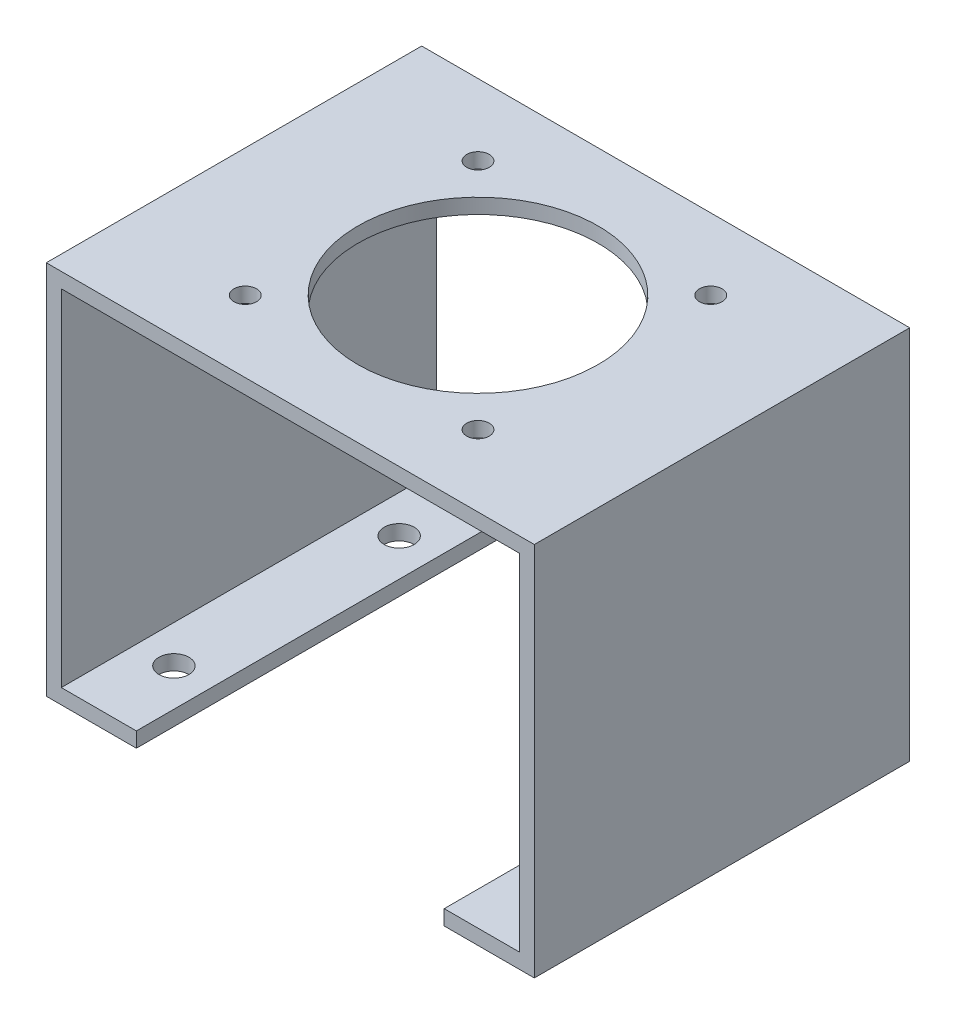
ISO-10303-21;
HEADER;
FILE_DESCRIPTION(('STEP AP214'),'2;1');
FILE_NAME('part.step','',(''),(''),'','','');
FILE_SCHEMA(('AUTOMOTIVE_DESIGN { 1 0 10303 214 1 1 1 1 }'));
ENDSEC;
DATA;
#1=APPLICATION_CONTEXT('core data for automotive mechanical design processes');
#2=APPLICATION_PROTOCOL_DEFINITION('international standard','automotive_design',2000,#1);
#3=PRODUCT_CONTEXT('',#1,'mechanical');
#4=PRODUCT('Part','Part','',(#3));
#5=PRODUCT_RELATED_PRODUCT_CATEGORY('part','',(#4));
#6=PRODUCT_DEFINITION_FORMATION('','',#4);
#7=PRODUCT_DEFINITION_CONTEXT('part definition',#1,'design');
#8=PRODUCT_DEFINITION('design','',#6,#7);
#9=PRODUCT_DEFINITION_SHAPE('','',#8);
#10=(LENGTH_UNIT() NAMED_UNIT(*) SI_UNIT(.MILLI.,.METRE.));
#11=(NAMED_UNIT(*) PLANE_ANGLE_UNIT() SI_UNIT($,.RADIAN.));
#12=(NAMED_UNIT(*) SI_UNIT($,.STERADIAN.) SOLID_ANGLE_UNIT());
#13=UNCERTAINTY_MEASURE_WITH_UNIT(LENGTH_MEASURE(1.E-05),#10,'distance_accuracy_value','');
#14=(GEOMETRIC_REPRESENTATION_CONTEXT(3) GLOBAL_UNCERTAINTY_ASSIGNED_CONTEXT((#13)) GLOBAL_UNIT_ASSIGNED_CONTEXT((#10,
#11,#12)) REPRESENTATION_CONTEXT('',''));
#15=CARTESIAN_POINT('',(0.,0.,0.));
#16=DIRECTION('',(0.,0.,1.));
#17=DIRECTION('',(1.,0.,0.));
#18=AXIS2_PLACEMENT_3D('',#15,#16,#17);
#19=CARTESIAN_POINT('',(0.,-2.,0.));
#20=DIRECTION('',(0.,1.,0.));
#21=DIRECTION('',(0.,0.,1.));
#22=AXIS2_PLACEMENT_3D('',#19,#20,#21);
#23=PLANE('',#22);
#24=CARTESIAN_POINT('',(0.,-2.,1.11022302462516E-13));
#25=DIRECTION('',(0.,1.,0.));
#26=DIRECTION('',(0.,0.,1.));
#27=AXIS2_PLACEMENT_3D('',#24,#25,#26);
#28=CIRCLE('',#27,16.);
#29=CARTESIAN_POINT('',(0.,-2.,16.0000000000001));
#30=VERTEX_POINT('',#29);
#31=EDGE_CURVE('E497',#30,#30,#28,.T.);
#32=ORIENTED_EDGE('',*,*,#31,.T.);
#33=EDGE_LOOP('',(#32));
#34=FACE_BOUND('',#33,.T.);
#35=CARTESIAN_POINT('',(15.5,-2.,-15.4999999999999));
#36=DIRECTION('',(0.,1.,0.));
#37=DIRECTION('',(0.,0.,1.));
#38=AXIS2_PLACEMENT_3D('',#35,#36,#37);
#39=CIRCLE('',#38,1.5);
#40=CARTESIAN_POINT('',(15.5,-2.,-13.9999999999999));
#41=VERTEX_POINT('',#40);
#42=EDGE_CURVE('E159',#41,#41,#39,.T.);
#43=ORIENTED_EDGE('',*,*,#42,.T.);
#44=EDGE_LOOP('',(#43));
#45=FACE_BOUND('',#44,.T.);
#46=CARTESIAN_POINT('',(15.5,-2.,15.5000000000001));
#47=DIRECTION('',(0.,1.,0.));
#48=DIRECTION('',(0.,0.,1.));
#49=AXIS2_PLACEMENT_3D('',#46,#47,#48);
#50=CIRCLE('',#49,1.5);
#51=CARTESIAN_POINT('',(15.5,-2.,17.0000000000001));
#52=VERTEX_POINT('',#51);
#53=EDGE_CURVE('E517',#52,#52,#50,.T.);
#54=ORIENTED_EDGE('',*,*,#53,.T.);
#55=EDGE_LOOP('',(#54));
#56=FACE_BOUND('',#55,.T.);
#57=CARTESIAN_POINT('',(-15.5,-2.,15.5000000000001));
#58=DIRECTION('',(0.,1.,0.));
#59=DIRECTION('',(0.,0.,1.));
#60=AXIS2_PLACEMENT_3D('',#57,#58,#59);
#61=CIRCLE('',#60,1.5);
#62=CARTESIAN_POINT('',(-15.5,-2.,17.0000000000001));
#63=VERTEX_POINT('',#62);
#64=EDGE_CURVE('E514',#63,#63,#61,.T.);
#65=ORIENTED_EDGE('',*,*,#64,.T.);
#66=EDGE_LOOP('',(#65));
#67=FACE_BOUND('',#66,.T.);
#68=CARTESIAN_POINT('',(-15.5,-2.,-15.4999999999999));
#69=DIRECTION('',(0.,1.,0.));
#70=DIRECTION('',(0.,0.,1.));
#71=AXIS2_PLACEMENT_3D('',#68,#69,#70);
#72=CIRCLE('',#71,1.5);
#73=CARTESIAN_POINT('',(-15.5,-2.,-13.9999999999999));
#74=VERTEX_POINT('',#73);
#75=EDGE_CURVE('E511',#74,#74,#72,.T.);
#76=ORIENTED_EDGE('',*,*,#75,.T.);
#77=EDGE_LOOP('',(#76));
#78=FACE_BOUND('',#77,.T.);
#79=DIRECTION('',(0.,0.,-1.));
#80=VECTOR('',#79,1.);
#81=CARTESIAN_POINT('',(30.5,-2.,0.));
#82=LINE('',#81,#80);
#83=CARTESIAN_POINT('',(30.5,-2.,25.));
#84=VERTEX_POINT('',#83);
#85=CARTESIAN_POINT('',(30.5,-2.,-25.));
#86=VERTEX_POINT('',#85);
#87=EDGE_CURVE('E169',#84,#86,#82,.T.);
#88=ORIENTED_EDGE('',*,*,#87,.F.);
#89=DIRECTION('',(1.,0.,0.));
#90=VECTOR('',#89,1.);
#91=CARTESIAN_POINT('',(32.5,-2.,25.));
#92=LINE('',#91,#90);
#93=CARTESIAN_POINT('',(-30.5,-2.,25.));
#94=VERTEX_POINT('',#93);
#95=EDGE_CURVE('E207',#94,#84,#92,.T.);
#96=ORIENTED_EDGE('',*,*,#95,.F.);
#97=DIRECTION('',(0.,0.,1.));
#98=VECTOR('',#97,1.);
#99=CARTESIAN_POINT('',(-30.5,-2.,0.));
#100=LINE('',#99,#98);
#101=CARTESIAN_POINT('',(-30.5,-2.,-25.));
#102=VERTEX_POINT('',#101);
#103=EDGE_CURVE('E201',#102,#94,#100,.T.);
#104=ORIENTED_EDGE('',*,*,#103,.F.);
#105=DIRECTION('',(-1.,0.,0.));
#106=VECTOR('',#105,1.);
#107=CARTESIAN_POINT('',(32.5,-2.,-25.));
#108=LINE('',#107,#106);
#109=EDGE_CURVE('E209',#86,#102,#108,.T.);
#110=ORIENTED_EDGE('',*,*,#109,.F.);
#111=EDGE_LOOP('',(#88,#96,#104,#110));
#112=FACE_BOUND('',#111,.T.);
#113=ADVANCED_FACE('F38',(#34,#45,#56,#67,#78,#112),#23,.F.);
#114=CARTESIAN_POINT('',(-30.5,0.,0.));
#115=DIRECTION('',(-1.,0.,0.));
#116=DIRECTION('',(0.,0.,1.));
#117=AXIS2_PLACEMENT_3D('',#114,#115,#116);
#118=PLANE('',#117);
#119=DIRECTION('',(0.,0.,1.));
#120=VECTOR('',#119,1.);
#121=CARTESIAN_POINT('',(-30.5,-48.,25.));
#122=LINE('',#121,#120);
#123=CARTESIAN_POINT('',(-30.5,-48.,-25.));
#124=VERTEX_POINT('',#123);
#125=CARTESIAN_POINT('',(-30.5,-48.,25.));
#126=VERTEX_POINT('',#125);
#127=EDGE_CURVE('E172',#124,#126,#122,.T.);
#128=ORIENTED_EDGE('',*,*,#127,.F.);
#129=DIRECTION('',(0.,-1.,0.));
#130=VECTOR('',#129,1.);
#131=CARTESIAN_POINT('',(-30.5,0.,-25.));
#132=LINE('',#131,#130);
#133=EDGE_CURVE('E190',#102,#124,#132,.T.);
#134=ORIENTED_EDGE('',*,*,#133,.F.);
#135=ORIENTED_EDGE('',*,*,#103,.T.);
#136=DIRECTION('',(0.,1.,0.));
#137=VECTOR('',#136,1.);
#138=CARTESIAN_POINT('',(-30.5,0.,25.));
#139=LINE('',#138,#137);
#140=EDGE_CURVE('E193',#126,#94,#139,.T.);
#141=ORIENTED_EDGE('',*,*,#140,.F.);
#142=EDGE_LOOP('',(#128,#134,#135,#141));
#143=FACE_BOUND('',#142,.T.);
#144=ADVANCED_FACE('F247',(#143),#118,.F.);
#145=CARTESIAN_POINT('',(-32.5,-2.,25.));
#146=DIRECTION('',(-1.,0.,0.));
#147=DIRECTION('',(0.,0.,1.));
#148=AXIS2_PLACEMENT_3D('',#145,#146,#147);
#149=PLANE('',#148);
#150=DIRECTION('',(0.,0.,1.));
#151=VECTOR('',#150,1.);
#152=CARTESIAN_POINT('',(-32.5,0.,25.));
#153=LINE('',#152,#151);
#154=CARTESIAN_POINT('',(-32.5,0.,-25.));
#155=VERTEX_POINT('',#154);
#156=CARTESIAN_POINT('',(-32.5,0.,25.));
#157=VERTEX_POINT('',#156);
#158=EDGE_CURVE('E206',#155,#157,#153,.T.);
#159=ORIENTED_EDGE('',*,*,#158,.F.);
#160=DIRECTION('',(0.,1.,0.));
#161=VECTOR('',#160,1.);
#162=CARTESIAN_POINT('',(-32.5,-2.,-25.));
#163=LINE('',#162,#161);
#164=CARTESIAN_POINT('',(-32.5,-50.,-25.));
#165=VERTEX_POINT('',#164);
#166=EDGE_CURVE('E11',#165,#155,#163,.T.);
#167=ORIENTED_EDGE('',*,*,#166,.F.);
#168=DIRECTION('',(0.,0.,1.));
#169=VECTOR('',#168,1.);
#170=CARTESIAN_POINT('',(-32.5,-50.,-25.));
#171=LINE('',#170,#169);
#172=CARTESIAN_POINT('',(-32.5,-50.,25.));
#173=VERTEX_POINT('',#172);
#174=EDGE_CURVE('E189',#165,#173,#171,.T.);
#175=ORIENTED_EDGE('',*,*,#174,.T.);
#176=DIRECTION('',(0.,1.,0.));
#177=VECTOR('',#176,1.);
#178=CARTESIAN_POINT('',(-32.5,-2.,25.));
#179=LINE('',#178,#177);
#180=EDGE_CURVE('E42',#173,#157,#179,.T.);
#181=ORIENTED_EDGE('',*,*,#180,.T.);
#182=EDGE_LOOP('',(#159,#167,#175,#181));
#183=FACE_BOUND('',#182,.T.);
#184=ADVANCED_FACE('F40',(#183),#149,.T.);
#185=CARTESIAN_POINT('',(32.5,-2.,-25.));
#186=DIRECTION('',(0.,0.,-1.));
#187=DIRECTION('',(-1.,0.,0.));
#188=AXIS2_PLACEMENT_3D('',#185,#186,#187);
#189=PLANE('',#188);
#190=DIRECTION('',(0.,1.,0.));
#191=VECTOR('',#190,1.);
#192=CARTESIAN_POINT('',(32.5,-2.,-25.));
#193=LINE('',#192,#191);
#194=CARTESIAN_POINT('',(32.5,-50.,-25.));
#195=VERTEX_POINT('',#194);
#196=CARTESIAN_POINT('',(32.5,0.,-25.));
#197=VERTEX_POINT('',#196);
#198=EDGE_CURVE('E47',#195,#197,#193,.T.);
#199=ORIENTED_EDGE('',*,*,#198,.F.);
#200=DIRECTION('',(1.,0.,0.));
#201=VECTOR('',#200,1.);
#202=CARTESIAN_POINT('',(30.5,-50.,-25.));
#203=LINE('',#202,#201);
#204=CARTESIAN_POINT('',(20.5,-50.,-25.));
#205=VERTEX_POINT('',#204);
#206=EDGE_CURVE('E166',#205,#195,#203,.T.);
#207=ORIENTED_EDGE('',*,*,#206,.F.);
#208=DIRECTION('',(0.,1.,0.));
#209=VECTOR('',#208,1.);
#210=CARTESIAN_POINT('',(20.5,-50.,-25.));
#211=LINE('',#210,#209);
#212=CARTESIAN_POINT('',(20.5,-48.,-25.));
#213=VERTEX_POINT('',#212);
#214=EDGE_CURVE('E152',#205,#213,#211,.T.);
#215=ORIENTED_EDGE('',*,*,#214,.T.);
#216=DIRECTION('',(1.,0.,0.));
#217=VECTOR('',#216,1.);
#218=CARTESIAN_POINT('',(20.5,-48.,-25.));
#219=LINE('',#218,#217);
#220=CARTESIAN_POINT('',(30.5,-48.,-25.));
#221=VERTEX_POINT('',#220);
#222=EDGE_CURVE('E140',#213,#221,#219,.T.);
#223=ORIENTED_EDGE('',*,*,#222,.T.);
#224=DIRECTION('',(0.,-1.,0.));
#225=VECTOR('',#224,1.);
#226=CARTESIAN_POINT('',(30.5,0.,-25.));
#227=LINE('',#226,#225);
#228=EDGE_CURVE('E55',#86,#221,#227,.T.);
#229=ORIENTED_EDGE('',*,*,#228,.F.);
#230=ORIENTED_EDGE('',*,*,#109,.T.);
#231=ORIENTED_EDGE('',*,*,#133,.T.);
#232=DIRECTION('',(-1.,0.,0.));
#233=VECTOR('',#232,1.);
#234=CARTESIAN_POINT('',(-20.5,-48.,-25.));
#235=LINE('',#234,#233);
#236=CARTESIAN_POINT('',(-20.5,-48.,-25.));
#237=VERTEX_POINT('',#236);
#238=EDGE_CURVE('E187',#237,#124,#235,.T.);
#239=ORIENTED_EDGE('',*,*,#238,.F.);
#240=DIRECTION('',(0.,1.,0.));
#241=VECTOR('',#240,1.);
#242=CARTESIAN_POINT('',(-20.5,-50.,-25.));
#243=LINE('',#242,#241);
#244=CARTESIAN_POINT('',(-20.5,-50.,-25.));
#245=VERTEX_POINT('',#244);
#246=EDGE_CURVE('E179',#245,#237,#243,.T.);
#247=ORIENTED_EDGE('',*,*,#246,.F.);
#248=DIRECTION('',(-1.,0.,0.));
#249=VECTOR('',#248,1.);
#250=CARTESIAN_POINT('',(-30.5,-50.,-25.));
#251=LINE('',#250,#249);
#252=EDGE_CURVE('E195',#245,#165,#251,.T.);
#253=ORIENTED_EDGE('',*,*,#252,.T.);
#254=ORIENTED_EDGE('',*,*,#166,.T.);
#255=DIRECTION('',(-1.,0.,0.));
#256=VECTOR('',#255,1.);
#257=CARTESIAN_POINT('',(32.5,0.,-25.));
#258=LINE('',#257,#256);
#259=EDGE_CURVE('E210',#197,#155,#258,.T.);
#260=ORIENTED_EDGE('',*,*,#259,.F.);
#261=EDGE_LOOP('',(#199,#207,#215,#223,#229,#230,#231,#239,#247,#253,#254,#260));
#262=FACE_BOUND('',#261,.T.);
#263=ADVANCED_FACE('F230',(#262),#189,.T.);
#264=CARTESIAN_POINT('',(32.5,-2.,25.));
#265=DIRECTION('',(1.,0.,0.));
#266=DIRECTION('',(0.,0.,-1.));
#267=AXIS2_PLACEMENT_3D('',#264,#265,#266);
#268=PLANE('',#267);
#269=DIRECTION('',(0.,0.,-1.));
#270=VECTOR('',#269,1.);
#271=CARTESIAN_POINT('',(32.5,0.,25.));
#272=LINE('',#271,#270);
#273=CARTESIAN_POINT('',(32.5,0.,25.));
#274=VERTEX_POINT('',#273);
#275=EDGE_CURVE('E216',#274,#197,#272,.T.);
#276=ORIENTED_EDGE('',*,*,#275,.F.);
#277=DIRECTION('',(0.,1.,0.));
#278=VECTOR('',#277,1.);
#279=CARTESIAN_POINT('',(32.5,-2.,25.));
#280=LINE('',#279,#278);
#281=CARTESIAN_POINT('',(32.5,-50.,25.));
#282=VERTEX_POINT('',#281);
#283=EDGE_CURVE('E220',#282,#274,#280,.T.);
#284=ORIENTED_EDGE('',*,*,#283,.F.);
#285=DIRECTION('',(0.,0.,1.));
#286=VECTOR('',#285,1.);
#287=CARTESIAN_POINT('',(32.5,-50.,-25.));
#288=LINE('',#287,#286);
#289=EDGE_CURVE('E139',#195,#282,#288,.T.);
#290=ORIENTED_EDGE('',*,*,#289,.F.);
#291=ORIENTED_EDGE('',*,*,#198,.T.);
#292=EDGE_LOOP('',(#276,#284,#290,#291));
#293=FACE_BOUND('',#292,.T.);
#294=ADVANCED_FACE('F281',(#293),#268,.T.);
#295=CARTESIAN_POINT('',(32.5,-2.,25.));
#296=DIRECTION('',(0.,0.,1.));
#297=DIRECTION('',(1.,0.,0.));
#298=AXIS2_PLACEMENT_3D('',#295,#296,#297);
#299=PLANE('',#298);
#300=ORIENTED_EDGE('',*,*,#283,.T.);
#301=DIRECTION('',(1.,0.,0.));
#302=VECTOR('',#301,1.);
#303=CARTESIAN_POINT('',(32.5,0.,25.));
#304=LINE('',#303,#302);
#305=EDGE_CURVE('E214',#157,#274,#304,.T.);
#306=ORIENTED_EDGE('',*,*,#305,.F.);
#307=ORIENTED_EDGE('',*,*,#180,.F.);
#308=DIRECTION('',(-1.,0.,0.));
#309=VECTOR('',#308,1.);
#310=CARTESIAN_POINT('',(-30.5,-50.,25.));
#311=LINE('',#310,#309);
#312=CARTESIAN_POINT('',(-20.5,-50.,25.));
#313=VERTEX_POINT('',#312);
#314=EDGE_CURVE('E198',#313,#173,#311,.T.);
#315=ORIENTED_EDGE('',*,*,#314,.F.);
#316=DIRECTION('',(0.,-1.,0.));
#317=VECTOR('',#316,1.);
#318=CARTESIAN_POINT('',(-20.5,-50.,25.));
#319=LINE('',#318,#317);
#320=CARTESIAN_POINT('',(-20.5,-48.,25.));
#321=VERTEX_POINT('',#320);
#322=EDGE_CURVE('E173',#321,#313,#319,.T.);
#323=ORIENTED_EDGE('',*,*,#322,.F.);
#324=DIRECTION('',(-1.,0.,0.));
#325=VECTOR('',#324,1.);
#326=CARTESIAN_POINT('',(-20.5,-48.,25.));
#327=LINE('',#326,#325);
#328=EDGE_CURVE('E183',#321,#126,#327,.T.);
#329=ORIENTED_EDGE('',*,*,#328,.T.);
#330=ORIENTED_EDGE('',*,*,#140,.T.);
#331=ORIENTED_EDGE('',*,*,#95,.T.);
#332=DIRECTION('',(0.,1.,0.));
#333=VECTOR('',#332,1.);
#334=CARTESIAN_POINT('',(30.5,0.,25.));
#335=LINE('',#334,#333);
#336=CARTESIAN_POINT('',(30.5,-48.,25.));
#337=VERTEX_POINT('',#336);
#338=EDGE_CURVE('E136',#337,#84,#335,.T.);
#339=ORIENTED_EDGE('',*,*,#338,.F.);
#340=DIRECTION('',(1.,0.,0.));
#341=VECTOR('',#340,1.);
#342=CARTESIAN_POINT('',(20.5,-48.,25.));
#343=LINE('',#342,#341);
#344=CARTESIAN_POINT('',(20.5,-48.,25.));
#345=VERTEX_POINT('',#344);
#346=EDGE_CURVE('E128',#345,#337,#343,.T.);
#347=ORIENTED_EDGE('',*,*,#346,.F.);
#348=DIRECTION('',(0.,-1.,0.));
#349=VECTOR('',#348,1.);
#350=CARTESIAN_POINT('',(20.5,-50.,25.));
#351=LINE('',#350,#349);
#352=CARTESIAN_POINT('',(20.5,-50.,25.));
#353=VERTEX_POINT('',#352);
#354=EDGE_CURVE('E133',#345,#353,#351,.T.);
#355=ORIENTED_EDGE('',*,*,#354,.T.);
#356=DIRECTION('',(1.,0.,0.));
#357=VECTOR('',#356,1.);
#358=CARTESIAN_POINT('',(30.5,-50.,25.));
#359=LINE('',#358,#357);
#360=EDGE_CURVE('E163',#353,#282,#359,.T.);
#361=ORIENTED_EDGE('',*,*,#360,.T.);
#362=EDGE_LOOP('',(#300,#306,#307,#315,#323,#329,#330,#331,#339,#347,#355,#361));
#363=FACE_BOUND('',#362,.T.);
#364=ADVANCED_FACE('F131',(#363),#299,.T.);
#365=CARTESIAN_POINT('',(0.,0.,0.));
#366=DIRECTION('',(0.,1.,0.));
#367=DIRECTION('',(0.,0.,1.));
#368=AXIS2_PLACEMENT_3D('',#365,#366,#367);
#369=PLANE('',#368);
#370=CARTESIAN_POINT('',(0.,0.,1.11022302462516E-13));
#371=DIRECTION('',(0.,1.,0.));
#372=DIRECTION('',(0.,0.,1.));
#373=AXIS2_PLACEMENT_3D('',#370,#371,#372);
#374=CIRCLE('',#373,16.);
#375=CARTESIAN_POINT('',(0.,0.,16.0000000000001));
#376=VERTEX_POINT('',#375);
#377=EDGE_CURVE('E494',#376,#376,#374,.T.);
#378=ORIENTED_EDGE('',*,*,#377,.F.);
#379=EDGE_LOOP('',(#378));
#380=FACE_BOUND('',#379,.T.);
#381=CARTESIAN_POINT('',(15.5,0.,-15.4999999999999));
#382=DIRECTION('',(0.,1.,0.));
#383=DIRECTION('',(0.,0.,1.));
#384=AXIS2_PLACEMENT_3D('',#381,#382,#383);
#385=CIRCLE('',#384,1.5);
#386=CARTESIAN_POINT('',(15.5,0.,-13.9999999999999));
#387=VERTEX_POINT('',#386);
#388=EDGE_CURVE('E499',#387,#387,#385,.T.);
#389=ORIENTED_EDGE('',*,*,#388,.F.);
#390=EDGE_LOOP('',(#389));
#391=FACE_BOUND('',#390,.T.);
#392=CARTESIAN_POINT('',(15.5,0.,15.5000000000001));
#393=DIRECTION('',(0.,1.,0.));
#394=DIRECTION('',(0.,0.,1.));
#395=AXIS2_PLACEMENT_3D('',#392,#393,#394);
#396=CIRCLE('',#395,1.5);
#397=CARTESIAN_POINT('',(15.5,0.,17.0000000000001));
#398=VERTEX_POINT('',#397);
#399=EDGE_CURVE('E504',#398,#398,#396,.T.);
#400=ORIENTED_EDGE('',*,*,#399,.F.);
#401=EDGE_LOOP('',(#400));
#402=FACE_BOUND('',#401,.T.);
#403=CARTESIAN_POINT('',(-15.5,0.,15.5000000000001));
#404=DIRECTION('',(0.,1.,0.));
#405=DIRECTION('',(0.,0.,1.));
#406=AXIS2_PLACEMENT_3D('',#403,#404,#405);
#407=CIRCLE('',#406,1.5);
#408=CARTESIAN_POINT('',(-15.5,0.,17.0000000000001));
#409=VERTEX_POINT('',#408);
#410=EDGE_CURVE('E500',#409,#409,#407,.T.);
#411=ORIENTED_EDGE('',*,*,#410,.F.);
#412=EDGE_LOOP('',(#411));
#413=FACE_BOUND('',#412,.T.);
#414=CARTESIAN_POINT('',(-15.5,0.,-15.4999999999999));
#415=DIRECTION('',(0.,1.,0.));
#416=DIRECTION('',(0.,0.,1.));
#417=AXIS2_PLACEMENT_3D('',#414,#415,#416);
#418=CIRCLE('',#417,1.5);
#419=CARTESIAN_POINT('',(-15.5,0.,-13.9999999999999));
#420=VERTEX_POINT('',#419);
#421=EDGE_CURVE('E503',#420,#420,#418,.T.);
#422=ORIENTED_EDGE('',*,*,#421,.F.);
#423=EDGE_LOOP('',(#422));
#424=FACE_BOUND('',#423,.T.);
#425=ORIENTED_EDGE('',*,*,#259,.T.);
#426=ORIENTED_EDGE('',*,*,#158,.T.);
#427=ORIENTED_EDGE('',*,*,#305,.T.);
#428=ORIENTED_EDGE('',*,*,#275,.T.);
#429=EDGE_LOOP('',(#425,#426,#427,#428));
#430=FACE_BOUND('',#429,.T.);
#431=ADVANCED_FACE('F227',(#380,#391,#402,#413,#424,#430),#369,.T.);
#432=CARTESIAN_POINT('',(-30.5,-50.,-25.));
#433=DIRECTION('',(0.,-1.,0.));
#434=DIRECTION('',(0.,0.,-1.));
#435=AXIS2_PLACEMENT_3D('',#432,#433,#434);
#436=PLANE('',#435);
#437=CARTESIAN_POINT('',(-25.5,-50.,-15.));
#438=DIRECTION('',(0.,-1.,0.));
#439=DIRECTION('',(0.,0.,-1.));
#440=AXIS2_PLACEMENT_3D('',#437,#438,#439);
#441=CIRCLE('',#440,2.);
#442=CARTESIAN_POINT('',(-25.5,-50.,-17.));
#443=VERTEX_POINT('',#442);
#444=EDGE_CURVE('E470',#443,#443,#441,.T.);
#445=ORIENTED_EDGE('',*,*,#444,.F.);
#446=EDGE_LOOP('',(#445));
#447=FACE_BOUND('',#446,.T.);
#448=CARTESIAN_POINT('',(-25.5,-50.,15.));
#449=DIRECTION('',(0.,-1.,0.));
#450=DIRECTION('',(0.,0.,-1.));
#451=AXIS2_PLACEMENT_3D('',#448,#449,#450);
#452=CIRCLE('',#451,2.);
#453=CARTESIAN_POINT('',(-25.5,-50.,13.));
#454=VERTEX_POINT('',#453);
#455=EDGE_CURVE('E490',#454,#454,#452,.T.);
#456=ORIENTED_EDGE('',*,*,#455,.F.);
#457=EDGE_LOOP('',(#456));
#458=FACE_BOUND('',#457,.T.);
#459=ORIENTED_EDGE('',*,*,#174,.F.);
#460=ORIENTED_EDGE('',*,*,#252,.F.);
#461=DIRECTION('',(0.,0.,-1.));
#462=VECTOR('',#461,1.);
#463=CARTESIAN_POINT('',(-20.5,-50.,25.));
#464=LINE('',#463,#462);
#465=EDGE_CURVE('E176',#313,#245,#464,.T.);
#466=ORIENTED_EDGE('',*,*,#465,.F.);
#467=ORIENTED_EDGE('',*,*,#314,.T.);
#468=EDGE_LOOP('',(#459,#460,#466,#467));
#469=FACE_BOUND('',#468,.T.);
#470=ADVANCED_FACE('F235',(#447,#458,#469),#436,.T.);
#471=CARTESIAN_POINT('',(-20.5,-48.,25.));
#472=DIRECTION('',(0.,-1.,0.));
#473=DIRECTION('',(0.,0.,-1.));
#474=AXIS2_PLACEMENT_3D('',#471,#472,#473);
#475=PLANE('',#474);
#476=CARTESIAN_POINT('',(-25.5,-48.,-15.));
#477=DIRECTION('',(0.,1.,0.));
#478=DIRECTION('',(0.,0.,-1.));
#479=AXIS2_PLACEMENT_3D('',#476,#477,#478);
#480=CIRCLE('',#479,2.);
#481=CARTESIAN_POINT('',(-25.5,-48.,-17.));
#482=VERTEX_POINT('',#481);
#483=EDGE_CURVE('E473',#482,#482,#480,.T.);
#484=ORIENTED_EDGE('',*,*,#483,.F.);
#485=EDGE_LOOP('',(#484));
#486=FACE_BOUND('',#485,.T.);
#487=CARTESIAN_POINT('',(-25.5,-48.,15.));
#488=DIRECTION('',(0.,1.,0.));
#489=DIRECTION('',(0.,0.,1.));
#490=AXIS2_PLACEMENT_3D('',#487,#488,#489);
#491=CIRCLE('',#490,2.);
#492=CARTESIAN_POINT('',(-25.5,-48.,17.));
#493=VERTEX_POINT('',#492);
#494=EDGE_CURVE('E481',#493,#493,#491,.T.);
#495=ORIENTED_EDGE('',*,*,#494,.F.);
#496=EDGE_LOOP('',(#495));
#497=FACE_BOUND('',#496,.T.);
#498=ORIENTED_EDGE('',*,*,#127,.T.);
#499=ORIENTED_EDGE('',*,*,#328,.F.);
#500=DIRECTION('',(0.,0.,1.));
#501=VECTOR('',#500,1.);
#502=CARTESIAN_POINT('',(-20.5,-48.,25.));
#503=LINE('',#502,#501);
#504=EDGE_CURVE('E181',#237,#321,#503,.T.);
#505=ORIENTED_EDGE('',*,*,#504,.F.);
#506=ORIENTED_EDGE('',*,*,#238,.T.);
#507=EDGE_LOOP('',(#498,#499,#505,#506));
#508=FACE_BOUND('',#507,.T.);
#509=ADVANCED_FACE('F243',(#486,#497,#508),#475,.F.);
#510=CARTESIAN_POINT('',(-20.5,0.,0.));
#511=DIRECTION('',(-1.,0.,0.));
#512=DIRECTION('',(0.,0.,1.));
#513=AXIS2_PLACEMENT_3D('',#510,#511,#512);
#514=PLANE('',#513);
#515=ORIENTED_EDGE('',*,*,#322,.T.);
#516=ORIENTED_EDGE('',*,*,#465,.T.);
#517=ORIENTED_EDGE('',*,*,#246,.T.);
#518=ORIENTED_EDGE('',*,*,#504,.T.);
#519=EDGE_LOOP('',(#515,#516,#517,#518));
#520=FACE_BOUND('',#519,.T.);
#521=ADVANCED_FACE('F240',(#520),#514,.F.);
#522=CARTESIAN_POINT('',(30.5,0.,0.));
#523=DIRECTION('',(1.,0.,0.));
#524=DIRECTION('',(0.,0.,1.));
#525=AXIS2_PLACEMENT_3D('',#522,#523,#524);
#526=PLANE('',#525);
#527=ORIENTED_EDGE('',*,*,#228,.T.);
#528=DIRECTION('',(0.,0.,1.));
#529=VECTOR('',#528,1.);
#530=CARTESIAN_POINT('',(30.5,-48.,25.));
#531=LINE('',#530,#529);
#532=EDGE_CURVE('E60',#221,#337,#531,.T.);
#533=ORIENTED_EDGE('',*,*,#532,.T.);
#534=ORIENTED_EDGE('',*,*,#338,.T.);
#535=ORIENTED_EDGE('',*,*,#87,.T.);
#536=EDGE_LOOP('',(#527,#533,#534,#535));
#537=FACE_BOUND('',#536,.T.);
#538=ADVANCED_FACE('F253',(#537),#526,.F.);
#539=CARTESIAN_POINT('',(30.5,-50.,-25.));
#540=DIRECTION('',(0.,1.,0.));
#541=DIRECTION('',(0.,0.,1.));
#542=AXIS2_PLACEMENT_3D('',#539,#540,#541);
#543=PLANE('',#542);
#544=CARTESIAN_POINT('',(25.5,-50.,-15.));
#545=DIRECTION('',(0.,1.,0.));
#546=DIRECTION('',(0.,0.,1.));
#547=AXIS2_PLACEMENT_3D('',#544,#545,#546);
#548=CIRCLE('',#547,2.);
#549=CARTESIAN_POINT('',(25.5,-50.,-13.));
#550=VERTEX_POINT('',#549);
#551=EDGE_CURVE('E487',#550,#550,#548,.T.);
#552=ORIENTED_EDGE('',*,*,#551,.T.);
#553=EDGE_LOOP('',(#552));
#554=FACE_BOUND('',#553,.T.);
#555=CARTESIAN_POINT('',(25.5,-50.,15.));
#556=DIRECTION('',(0.,1.,0.));
#557=DIRECTION('',(0.,0.,1.));
#558=AXIS2_PLACEMENT_3D('',#555,#556,#557);
#559=CIRCLE('',#558,2.);
#560=CARTESIAN_POINT('',(25.5,-50.,17.));
#561=VERTEX_POINT('',#560);
#562=EDGE_CURVE('E484',#561,#561,#559,.T.);
#563=ORIENTED_EDGE('',*,*,#562,.T.);
#564=EDGE_LOOP('',(#563));
#565=FACE_BOUND('',#564,.T.);
#566=ORIENTED_EDGE('',*,*,#289,.T.);
#567=ORIENTED_EDGE('',*,*,#360,.F.);
#568=DIRECTION('',(0.,0.,-1.));
#569=VECTOR('',#568,1.);
#570=CARTESIAN_POINT('',(20.5,-50.,25.));
#571=LINE('',#570,#569);
#572=EDGE_CURVE('E149',#353,#205,#571,.T.);
#573=ORIENTED_EDGE('',*,*,#572,.T.);
#574=ORIENTED_EDGE('',*,*,#206,.T.);
#575=EDGE_LOOP('',(#566,#567,#573,#574));
#576=FACE_BOUND('',#575,.T.);
#577=ADVANCED_FACE('F255',(#554,#565,#576),#543,.F.);
#578=CARTESIAN_POINT('',(20.5,-48.,25.));
#579=DIRECTION('',(0.,1.,0.));
#580=DIRECTION('',(0.,0.,1.));
#581=AXIS2_PLACEMENT_3D('',#578,#579,#580);
#582=PLANE('',#581);
#583=CARTESIAN_POINT('',(25.5,-48.,-15.));
#584=DIRECTION('',(0.,1.,0.));
#585=DIRECTION('',(0.,0.,1.));
#586=AXIS2_PLACEMENT_3D('',#583,#584,#585);
#587=CIRCLE('',#586,2.);
#588=CARTESIAN_POINT('',(25.5,-48.,-13.));
#589=VERTEX_POINT('',#588);
#590=EDGE_CURVE('E474',#589,#589,#587,.T.);
#591=ORIENTED_EDGE('',*,*,#590,.F.);
#592=EDGE_LOOP('',(#591));
#593=FACE_BOUND('',#592,.T.);
#594=CARTESIAN_POINT('',(25.5,-48.,15.));
#595=DIRECTION('',(0.,1.,0.));
#596=DIRECTION('',(0.,0.,-1.));
#597=AXIS2_PLACEMENT_3D('',#594,#595,#596);
#598=CIRCLE('',#597,2.);
#599=CARTESIAN_POINT('',(25.5,-48.,13.));
#600=VERTEX_POINT('',#599);
#601=EDGE_CURVE('E477',#600,#600,#598,.T.);
#602=ORIENTED_EDGE('',*,*,#601,.F.);
#603=EDGE_LOOP('',(#602));
#604=FACE_BOUND('',#603,.T.);
#605=ORIENTED_EDGE('',*,*,#532,.F.);
#606=ORIENTED_EDGE('',*,*,#222,.F.);
#607=DIRECTION('',(0.,0.,1.));
#608=VECTOR('',#607,1.);
#609=CARTESIAN_POINT('',(20.5,-48.,25.));
#610=LINE('',#609,#608);
#611=EDGE_CURVE('E146',#213,#345,#610,.T.);
#612=ORIENTED_EDGE('',*,*,#611,.T.);
#613=ORIENTED_EDGE('',*,*,#346,.T.);
#614=EDGE_LOOP('',(#605,#606,#612,#613));
#615=FACE_BOUND('',#614,.T.);
#616=ADVANCED_FACE('F151',(#593,#604,#615),#582,.T.);
#617=CARTESIAN_POINT('',(20.5,0.,0.));
#618=DIRECTION('',(1.,0.,0.));
#619=DIRECTION('',(0.,0.,1.));
#620=AXIS2_PLACEMENT_3D('',#617,#618,#619);
#621=PLANE('',#620);
#622=ORIENTED_EDGE('',*,*,#354,.F.);
#623=ORIENTED_EDGE('',*,*,#611,.F.);
#624=ORIENTED_EDGE('',*,*,#214,.F.);
#625=ORIENTED_EDGE('',*,*,#572,.F.);
#626=EDGE_LOOP('',(#622,#623,#624,#625));
#627=FACE_BOUND('',#626,.T.);
#628=ADVANCED_FACE('F144',(#627),#621,.F.);
#629=CARTESIAN_POINT('',(-15.5,-50.,-15.4999999999999));
#630=DIRECTION('',(0.,1.,0.));
#631=DIRECTION('',(0.,0.,1.));
#632=AXIS2_PLACEMENT_3D('',#629,#630,#631);
#633=CYLINDRICAL_SURFACE('',#632,1.5);
#634=ORIENTED_EDGE('',*,*,#421,.T.);
#635=EDGE_LOOP('',(#634));
#636=FACE_BOUND('',#635,.T.);
#637=ORIENTED_EDGE('',*,*,#75,.F.);
#638=EDGE_LOOP('',(#637));
#639=FACE_BOUND('',#638,.T.);
#640=ADVANCED_FACE('F375',(#636,#639),#633,.F.);
#641=CARTESIAN_POINT('',(-15.5,-50.,15.5000000000001));
#642=DIRECTION('',(0.,1.,0.));
#643=DIRECTION('',(0.,0.,1.));
#644=AXIS2_PLACEMENT_3D('',#641,#642,#643);
#645=CYLINDRICAL_SURFACE('',#644,1.5);
#646=ORIENTED_EDGE('',*,*,#410,.T.);
#647=EDGE_LOOP('',(#646));
#648=FACE_BOUND('',#647,.T.);
#649=ORIENTED_EDGE('',*,*,#64,.F.);
#650=EDGE_LOOP('',(#649));
#651=FACE_BOUND('',#650,.T.);
#652=ADVANCED_FACE('F383',(#648,#651),#645,.F.);
#653=CARTESIAN_POINT('',(15.5,-50.,15.5000000000001));
#654=DIRECTION('',(0.,1.,0.));
#655=DIRECTION('',(0.,0.,1.));
#656=AXIS2_PLACEMENT_3D('',#653,#654,#655);
#657=CYLINDRICAL_SURFACE('',#656,1.5);
#658=ORIENTED_EDGE('',*,*,#399,.T.);
#659=EDGE_LOOP('',(#658));
#660=FACE_BOUND('',#659,.T.);
#661=ORIENTED_EDGE('',*,*,#53,.F.);
#662=EDGE_LOOP('',(#661));
#663=FACE_BOUND('',#662,.T.);
#664=ADVANCED_FACE('F392',(#660,#663),#657,.F.);
#665=CARTESIAN_POINT('',(15.5,-50.,-15.4999999999999));
#666=DIRECTION('',(0.,1.,0.));
#667=DIRECTION('',(0.,0.,1.));
#668=AXIS2_PLACEMENT_3D('',#665,#666,#667);
#669=CYLINDRICAL_SURFACE('',#668,1.5);
#670=ORIENTED_EDGE('',*,*,#388,.T.);
#671=EDGE_LOOP('',(#670));
#672=FACE_BOUND('',#671,.T.);
#673=ORIENTED_EDGE('',*,*,#42,.F.);
#674=EDGE_LOOP('',(#673));
#675=FACE_BOUND('',#674,.T.);
#676=ADVANCED_FACE('F401',(#672,#675),#669,.F.);
#677=CARTESIAN_POINT('',(0.,-10.,1.11022302462516E-13));
#678=DIRECTION('',(0.,1.,0.));
#679=DIRECTION('',(0.,0.,1.));
#680=AXIS2_PLACEMENT_3D('',#677,#678,#679);
#681=CYLINDRICAL_SURFACE('',#680,16.);
#682=ORIENTED_EDGE('',*,*,#377,.T.);
#683=EDGE_LOOP('',(#682));
#684=FACE_BOUND('',#683,.T.);
#685=ORIENTED_EDGE('',*,*,#31,.F.);
#686=EDGE_LOOP('',(#685));
#687=FACE_BOUND('',#686,.T.);
#688=ADVANCED_FACE('F410',(#684,#687),#681,.F.);
#689=CARTESIAN_POINT('',(25.5,-58.,15.));
#690=DIRECTION('',(0.,1.,0.));
#691=DIRECTION('',(0.,0.,1.));
#692=AXIS2_PLACEMENT_3D('',#689,#690,#691);
#693=CYLINDRICAL_SURFACE('',#692,2.);
#694=ORIENTED_EDGE('',*,*,#601,.T.);
#695=EDGE_LOOP('',(#694));
#696=FACE_BOUND('',#695,.T.);
#697=ORIENTED_EDGE('',*,*,#562,.F.);
#698=EDGE_LOOP('',(#697));
#699=FACE_BOUND('',#698,.T.);
#700=ADVANCED_FACE('F418',(#696,#699),#693,.F.);
#701=CARTESIAN_POINT('',(25.5,-58.,-15.));
#702=DIRECTION('',(0.,1.,0.));
#703=DIRECTION('',(0.,0.,1.));
#704=AXIS2_PLACEMENT_3D('',#701,#702,#703);
#705=CYLINDRICAL_SURFACE('',#704,2.);
#706=ORIENTED_EDGE('',*,*,#590,.T.);
#707=EDGE_LOOP('',(#706));
#708=FACE_BOUND('',#707,.T.);
#709=ORIENTED_EDGE('',*,*,#551,.F.);
#710=EDGE_LOOP('',(#709));
#711=FACE_BOUND('',#710,.T.);
#712=ADVANCED_FACE('F426',(#708,#711),#705,.F.);
#713=CARTESIAN_POINT('',(-25.5,-58.,15.));
#714=DIRECTION('',(0.,1.,0.));
#715=DIRECTION('',(0.,0.,1.));
#716=AXIS2_PLACEMENT_3D('',#713,#714,#715);
#717=CYLINDRICAL_SURFACE('',#716,2.);
#718=ORIENTED_EDGE('',*,*,#455,.T.);
#719=EDGE_LOOP('',(#718));
#720=FACE_BOUND('',#719,.T.);
#721=ORIENTED_EDGE('',*,*,#494,.T.);
#722=EDGE_LOOP('',(#721));
#723=FACE_BOUND('',#722,.T.);
#724=ADVANCED_FACE('F435',(#720,#723),#717,.F.);
#725=CARTESIAN_POINT('',(-25.5,-58.,-15.));
#726=DIRECTION('',(0.,1.,0.));
#727=DIRECTION('',(0.,0.,1.));
#728=AXIS2_PLACEMENT_3D('',#725,#726,#727);
#729=CYLINDRICAL_SURFACE('',#728,2.);
#730=ORIENTED_EDGE('',*,*,#444,.T.);
#731=EDGE_LOOP('',(#730));
#732=FACE_BOUND('',#731,.T.);
#733=ORIENTED_EDGE('',*,*,#483,.T.);
#734=EDGE_LOOP('',(#733));
#735=FACE_BOUND('',#734,.T.);
#736=ADVANCED_FACE('F444',(#732,#735),#729,.F.);
#737=CLOSED_SHELL('',(#113,#144,#184,#263,#294,#364,#431,#470,#509,#521,#538,#577,#616,#628,
#640,#652,#664,#676,#688,#700,#712,#724,#736));
#738=MANIFOLD_SOLID_BREP('B2',#737);
#739=ADVANCED_BREP_SHAPE_REPRESENTATION('',(#18,#738),#14);
#740=SHAPE_DEFINITION_REPRESENTATION(#9,#739);
ENDSEC;
END-ISO-10303-21;
